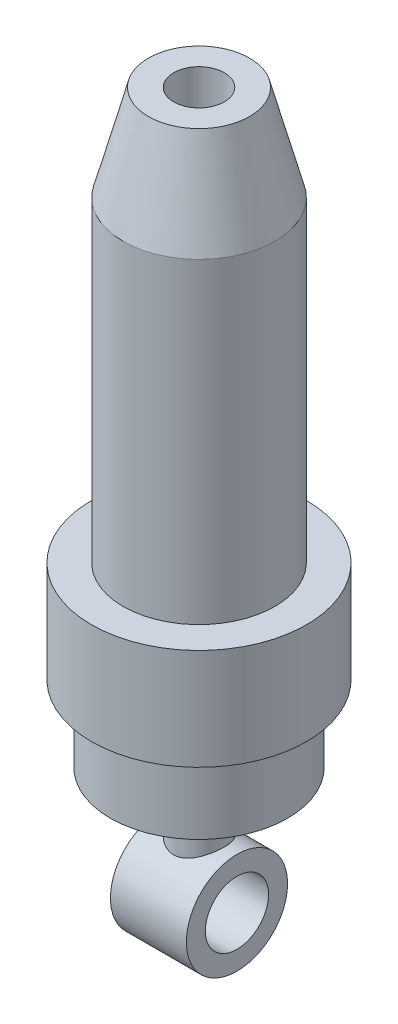
ISO-10303-21;
HEADER;
FILE_DESCRIPTION(('STEP AP214'),'2;1');
FILE_NAME('part.step','',(''),(''),'','','');
FILE_SCHEMA(('AUTOMOTIVE_DESIGN { 1 0 10303 214 1 1 1 1 }'));
ENDSEC;
DATA;
#1=APPLICATION_CONTEXT('core data for automotive mechanical design processes');
#2=APPLICATION_PROTOCOL_DEFINITION('international standard','automotive_design',2000,#1);
#3=PRODUCT_CONTEXT('',#1,'mechanical');
#4=PRODUCT('Part','Part','',(#3));
#5=PRODUCT_RELATED_PRODUCT_CATEGORY('part','',(#4));
#6=PRODUCT_DEFINITION_FORMATION('','',#4);
#7=PRODUCT_DEFINITION_CONTEXT('part definition',#1,'design');
#8=PRODUCT_DEFINITION('design','',#6,#7);
#9=PRODUCT_DEFINITION_SHAPE('','',#8);
#10=(LENGTH_UNIT() NAMED_UNIT(*) SI_UNIT(.MILLI.,.METRE.));
#11=(NAMED_UNIT(*) PLANE_ANGLE_UNIT() SI_UNIT($,.RADIAN.));
#12=(NAMED_UNIT(*) SI_UNIT($,.STERADIAN.) SOLID_ANGLE_UNIT());
#13=UNCERTAINTY_MEASURE_WITH_UNIT(LENGTH_MEASURE(1.E-05),#10,'distance_accuracy_value','');
#14=(GEOMETRIC_REPRESENTATION_CONTEXT(3) GLOBAL_UNCERTAINTY_ASSIGNED_CONTEXT((#13)) GLOBAL_UNIT_ASSIGNED_CONTEXT((#10,
#11,#12)) REPRESENTATION_CONTEXT('',''));
#15=CARTESIAN_POINT('',(0.,0.,0.));
#16=DIRECTION('',(0.,0.,1.));
#17=DIRECTION('',(1.,0.,0.));
#18=AXIS2_PLACEMENT_3D('',#15,#16,#17);
#19=CARTESIAN_POINT('',(0.,-10.,0.));
#20=DIRECTION('',(0.,-1.,0.));
#21=DIRECTION('',(0.,0.,-1.));
#22=AXIS2_PLACEMENT_3D('',#19,#20,#21);
#23=PLANE('',#22);
#24=CARTESIAN_POINT('',(0.,-10.,0.));
#25=DIRECTION('',(0.,1.,0.));
#26=DIRECTION('',(0.,0.,1.));
#27=AXIS2_PLACEMENT_3D('',#24,#25,#26);
#28=CIRCLE('',#27,2.);
#29=CARTESIAN_POINT('',(0.,-10.,2.));
#30=VERTEX_POINT('',#29);
#31=EDGE_CURVE('E114',#30,#30,#28,.T.);
#32=ORIENTED_EDGE('',*,*,#31,.F.);
#33=EDGE_LOOP('',(#32));
#34=FACE_BOUND('',#33,.T.);
#35=CARTESIAN_POINT('',(0.,-10.,0.));
#36=DIRECTION('',(0.,1.,0.));
#37=DIRECTION('',(0.,0.,1.));
#38=AXIS2_PLACEMENT_3D('',#35,#36,#37);
#39=CIRCLE('',#38,4.);
#40=CARTESIAN_POINT('',(0.,-10.,4.));
#41=VERTEX_POINT('',#40);
#42=EDGE_CURVE('E10',#41,#41,#39,.T.);
#43=ORIENTED_EDGE('',*,*,#42,.T.);
#44=EDGE_LOOP('',(#43));
#45=FACE_BOUND('',#44,.T.);
#46=ADVANCED_FACE('F34',(#34,#45),#23,.F.);
#47=CARTESIAN_POINT('',(0.,-17.5358983848622,0.));
#48=DIRECTION('',(0.,-1.,0.));
#49=DIRECTION('',(0.,0.,-1.));
#50=AXIS2_PLACEMENT_3D('',#47,#48,#49);
#51=CONICAL_SURFACE('',#50,6.,0.259416046073647);
#52=ORIENTED_EDGE('',*,*,#42,.F.);
#53=EDGE_LOOP('',(#52));
#54=FACE_BOUND('',#53,.T.);
#55=CARTESIAN_POINT('',(0.,-17.5358983848622,0.));
#56=DIRECTION('',(0.,1.,0.));
#57=DIRECTION('',(0.,0.,1.));
#58=AXIS2_PLACEMENT_3D('',#55,#56,#57);
#59=CIRCLE('',#58,6.);
#60=CARTESIAN_POINT('',(0.,-17.5358983848622,6.));
#61=VERTEX_POINT('',#60);
#62=EDGE_CURVE('E40',#61,#61,#59,.T.);
#63=ORIENTED_EDGE('',*,*,#62,.T.);
#64=EDGE_LOOP('',(#63));
#65=FACE_BOUND('',#64,.T.);
#66=ADVANCED_FACE('F105',(#54,#65),#51,.T.);
#67=CARTESIAN_POINT('',(0.,-10.,0.));
#68=DIRECTION('',(0.,1.,0.));
#69=DIRECTION('',(0.,0.,1.));
#70=AXIS2_PLACEMENT_3D('',#67,#68,#69);
#71=CYLINDRICAL_SURFACE('',#70,6.);
#72=ORIENTED_EDGE('',*,*,#62,.F.);
#73=EDGE_LOOP('',(#72));
#74=FACE_BOUND('',#73,.T.);
#75=CARTESIAN_POINT('',(0.,-42.5358983848622,0.));
#76=DIRECTION('',(0.,1.,0.));
#77=DIRECTION('',(0.,0.,1.));
#78=AXIS2_PLACEMENT_3D('',#75,#76,#77);
#79=CIRCLE('',#78,6.);
#80=CARTESIAN_POINT('',(0.,-42.5358983848622,5.99999999999999));
#81=VERTEX_POINT('',#80);
#82=EDGE_CURVE('E44',#81,#81,#79,.T.);
#83=ORIENTED_EDGE('',*,*,#82,.T.);
#84=EDGE_LOOP('',(#83));
#85=FACE_BOUND('',#84,.T.);
#86=ADVANCED_FACE('F110',(#74,#85),#71,.T.);
#87=CARTESIAN_POINT('',(0.,-42.5358983848622,-6.));
#88=DIRECTION('',(0.,-1.,0.));
#89=DIRECTION('',(0.,0.,-1.));
#90=AXIS2_PLACEMENT_3D('',#87,#88,#89);
#91=PLANE('',#90);
#92=ORIENTED_EDGE('',*,*,#82,.F.);
#93=EDGE_LOOP('',(#92));
#94=FACE_BOUND('',#93,.T.);
#95=CARTESIAN_POINT('',(0.,-42.5358983848622,0.));
#96=DIRECTION('',(0.,1.,0.));
#97=DIRECTION('',(0.,0.,1.));
#98=AXIS2_PLACEMENT_3D('',#95,#96,#97);
#99=CIRCLE('',#98,8.5);
#100=CARTESIAN_POINT('',(0.,-42.5358983848622,8.49999999999999));
#101=VERTEX_POINT('',#100);
#102=EDGE_CURVE('E48',#101,#101,#99,.T.);
#103=ORIENTED_EDGE('',*,*,#102,.T.);
#104=EDGE_LOOP('',(#103));
#105=FACE_BOUND('',#104,.T.);
#106=ADVANCED_FACE('F159',(#94,#105),#91,.F.);
#107=CARTESIAN_POINT('',(0.,-10.,0.));
#108=DIRECTION('',(0.,1.,0.));
#109=DIRECTION('',(0.,0.,1.));
#110=AXIS2_PLACEMENT_3D('',#107,#108,#109);
#111=CYLINDRICAL_SURFACE('',#110,8.5);
#112=ORIENTED_EDGE('',*,*,#102,.F.);
#113=EDGE_LOOP('',(#112));
#114=FACE_BOUND('',#113,.T.);
#115=CARTESIAN_POINT('',(0.,-50.5358983848622,0.));
#116=DIRECTION('',(0.,1.,0.));
#117=DIRECTION('',(0.,0.,1.));
#118=AXIS2_PLACEMENT_3D('',#115,#116,#117);
#119=CIRCLE('',#118,8.5);
#120=CARTESIAN_POINT('',(0.,-50.5358983848622,8.49999999999999));
#121=VERTEX_POINT('',#120);
#122=EDGE_CURVE('E53',#121,#121,#119,.T.);
#123=ORIENTED_EDGE('',*,*,#122,.T.);
#124=EDGE_LOOP('',(#123));
#125=FACE_BOUND('',#124,.T.);
#126=ADVANCED_FACE('F155',(#114,#125),#111,.T.);
#127=CARTESIAN_POINT('',(0.,-50.5358983848622,-8.50000000000001));
#128=DIRECTION('',(0.,1.,0.));
#129=DIRECTION('',(0.,0.,1.));
#130=AXIS2_PLACEMENT_3D('',#127,#128,#129);
#131=PLANE('',#130);
#132=ORIENTED_EDGE('',*,*,#122,.F.);
#133=EDGE_LOOP('',(#132));
#134=FACE_BOUND('',#133,.T.);
#135=CARTESIAN_POINT('',(0.,-50.5358983848622,0.));
#136=DIRECTION('',(0.,1.,0.));
#137=DIRECTION('',(0.,0.,1.));
#138=AXIS2_PLACEMENT_3D('',#135,#136,#137);
#139=CIRCLE('',#138,7.);
#140=CARTESIAN_POINT('',(0.,-50.5358983848622,6.99999999999999));
#141=VERTEX_POINT('',#140);
#142=EDGE_CURVE('E56',#141,#141,#139,.T.);
#143=ORIENTED_EDGE('',*,*,#142,.T.);
#144=EDGE_LOOP('',(#143));
#145=FACE_BOUND('',#144,.T.);
#146=ADVANCED_FACE('F148',(#134,#145),#131,.F.);
#147=CARTESIAN_POINT('',(0.,-10.,0.));
#148=DIRECTION('',(0.,1.,0.));
#149=DIRECTION('',(0.,0.,1.));
#150=AXIS2_PLACEMENT_3D('',#147,#148,#149);
#151=CYLINDRICAL_SURFACE('',#150,7.);
#152=ORIENTED_EDGE('',*,*,#142,.F.);
#153=EDGE_LOOP('',(#152));
#154=FACE_BOUND('',#153,.T.);
#155=CARTESIAN_POINT('',(0.,-56.5358983848622,0.));
#156=DIRECTION('',(0.,1.,0.));
#157=DIRECTION('',(0.,0.,1.));
#158=AXIS2_PLACEMENT_3D('',#155,#156,#157);
#159=CIRCLE('',#158,7.);
#160=CARTESIAN_POINT('',(0.,-56.5358983848622,6.99999999999999));
#161=VERTEX_POINT('',#160);
#162=EDGE_CURVE('E59',#161,#161,#159,.T.);
#163=ORIENTED_EDGE('',*,*,#162,.T.);
#164=EDGE_LOOP('',(#163));
#165=FACE_BOUND('',#164,.T.);
#166=ADVANCED_FACE('F141',(#154,#165),#151,.T.);
#167=CARTESIAN_POINT('',(0.,-56.5358983848622,-7.00000000000001));
#168=DIRECTION('',(0.,1.,0.));
#169=DIRECTION('',(0.,0.,1.));
#170=AXIS2_PLACEMENT_3D('',#167,#168,#169);
#171=PLANE('',#170);
#172=ORIENTED_EDGE('',*,*,#162,.F.);
#173=EDGE_LOOP('',(#172));
#174=FACE_BOUND('',#173,.T.);
#175=CARTESIAN_POINT('',(0.,-56.5358983848623,0.));
#176=DIRECTION('',(0.,1.,0.));
#177=DIRECTION('',(0.,0.,1.));
#178=AXIS2_PLACEMENT_3D('',#175,#176,#177);
#179=CIRCLE('',#178,2.);
#180=CARTESIAN_POINT('',(0.,-56.5358983848623,1.99999999999999));
#181=VERTEX_POINT('',#180);
#182=EDGE_CURVE('E62',#181,#181,#179,.T.);
#183=ORIENTED_EDGE('',*,*,#182,.T.);
#184=EDGE_LOOP('',(#183));
#185=FACE_BOUND('',#184,.T.);
#186=ADVANCED_FACE('F136',(#174,#185),#171,.F.);
#187=CARTESIAN_POINT('',(0.,-10.,0.));
#188=DIRECTION('',(0.,1.,0.));
#189=DIRECTION('',(0.,0.,1.));
#190=AXIS2_PLACEMENT_3D('',#187,#188,#189);
#191=CYLINDRICAL_SURFACE('',#190,2.);
#192=ORIENTED_EDGE('',*,*,#182,.F.);
#193=EDGE_LOOP('',(#192));
#194=FACE_BOUND('',#193,.T.);
#195=CARTESIAN_POINT('',(0.,-61.5358983848622,1.99999999999999));
#196=CARTESIAN_POINT('',(0.104213205474344,-61.5358881428411,1.99999158748779));
#197=CARTESIAN_POINT('',(0.208562176533798,-61.5311236645502,1.99179963610435));
#198=CARTESIAN_POINT('',(0.414055177230599,-61.5127529833093,1.95944672580051));
#199=CARTESIAN_POINT('',(0.515192003247759,-61.4991282021182,1.9352522109566));
#200=CARTESIAN_POINT('',(0.710903156446932,-61.4650129851,1.87219981598029));
#201=CARTESIAN_POINT('',(0.805509258849248,-61.4445591093083,1.83341988295962));
#202=CARTESIAN_POINT('',(0.986848450476151,-61.3991467270887,1.74253507245137));
#203=CARTESIAN_POINT('',(1.07358111343677,-61.3741879769875,1.69042947410137));
#204=CARTESIAN_POINT('',(1.24461144313338,-61.3200626118071,1.56933307453799));
#205=CARTESIAN_POINT('',(1.32811826759177,-61.290718725349,1.49930407053532));
#206=CARTESIAN_POINT('',(1.4828167805706,-61.2325603461788,1.346507616982));
#207=CARTESIAN_POINT('',(1.55400232620397,-61.2037461238974,1.2637338520484));
#208=CARTESIAN_POINT('',(1.68673430118849,-61.1475704603834,1.08097912631264));
#209=CARTESIAN_POINT('',(1.7473075354233,-61.1204378714875,0.98021437788714));
#210=CARTESIAN_POINT('',(1.85028170678709,-61.0729848781583,0.768314053336905));
#211=CARTESIAN_POINT('',(1.89269411235079,-61.0526601763637,0.657185076311973));
#212=CARTESIAN_POINT('',(1.95500932253117,-61.0223907750795,0.436089887818805));
#213=CARTESIAN_POINT('',(1.9762990526921,-61.0118103955726,0.326603580968774));
#214=CARTESIAN_POINT('',(2.00033223736903,-60.9998483230882,0.10514125740453));
#215=CARTESIAN_POINT('',(2.00308691359628,-60.9984610643107,-0.00683321168521773));
#216=CARTESIAN_POINT('',(1.99050665205486,-61.0047403616688,-0.219665048849582));
#217=CARTESIAN_POINT('',(1.97672396895636,-61.0116300821562,-0.320642398354148));
#218=CARTESIAN_POINT('',(1.93423831219187,-61.0325150948057,-0.518627543836098));
#219=CARTESIAN_POINT('',(1.90553422204787,-61.0465109186723,-0.61563504218771));
#220=CARTESIAN_POINT('',(1.83383486782004,-61.0805683342467,-0.804618783139268));
#221=CARTESIAN_POINT('',(1.79064737365577,-61.100711169416,-0.896506847030406));
#222=CARTESIAN_POINT('',(1.6914731675971,-61.1452470802663,-1.07195360302662));
#223=CARTESIAN_POINT('',(1.63548187339532,-61.1696416768503,-1.15550929767729));
#224=CARTESIAN_POINT('',(1.50620929693394,-61.2231121120154,-1.32034732179641));
#225=CARTESIAN_POINT('',(1.43179394334797,-61.2524124800365,-1.40066815005873));
#226=CARTESIAN_POINT('',(1.27082055013965,-61.3109131882638,-1.54820874059557));
#227=CARTESIAN_POINT('',(1.18425325545187,-61.3401134346874,-1.61541842314847));
#228=CARTESIAN_POINT('',(0.994703615151819,-61.3971168781503,-1.73901066928443));
#229=CARTESIAN_POINT('',(0.891027953891573,-61.4247136001858,-1.79443462995611));
#230=CARTESIAN_POINT('',(0.674124657282,-61.4724909944285,-1.88663822600247));
#231=CARTESIAN_POINT('',(0.560907133964871,-61.4926793990787,-1.92343731642179));
#232=CARTESIAN_POINT('',(0.337570977434418,-61.5211072836593,-1.97436042205009));
#233=CARTESIAN_POINT('',(0.2279177619129,-61.5301668830301,-1.99005024423996));
#234=CARTESIAN_POINT('',(0.00719731696690866,-61.5376416127678,-2.00303389322286));
#235=CARTESIAN_POINT('',(-0.103868858239598,-61.5360642622138,-2.00034071463006));
#236=CARTESIAN_POINT('',(-0.311307837157438,-61.5233132691883,-1.97807208668794));
#237=CARTESIAN_POINT('',(-0.407958902215785,-61.5132082498669,-1.96037563342493));
#238=CARTESIAN_POINT('',(-0.596735572541989,-61.4861195689732,-1.9113925692649));
#239=CARTESIAN_POINT('',(-0.688859701493481,-61.4691336798993,-1.88010155724727));
#240=CARTESIAN_POINT('',(-0.870822661805114,-61.4292755584069,-1.80329517720974));
#241=CARTESIAN_POINT('',(-0.960358033706049,-61.4061671351387,-1.7571881273853));
#242=CARTESIAN_POINT('',(-1.13093854307904,-61.356877610055,-1.65257412803176));
#243=CARTESIAN_POINT('',(-1.21197928703051,-61.330694932897,-1.59406080866499));
#244=CARTESIAN_POINT('',(-1.37395753504265,-61.2742400308733,-1.45767433439709));
#245=CARTESIAN_POINT('',(-1.45359430141777,-61.2438683369143,-1.37829054462748));
#246=CARTESIAN_POINT('',(-1.59882447600473,-61.185315300442,-1.20680899079904));
#247=CARTESIAN_POINT('',(-1.66441314052683,-61.1571346998454,-1.11470694931991));
#248=CARTESIAN_POINT('',(-1.78114745183271,-61.1051727661813,-0.917070725108065));
#249=CARTESIAN_POINT('',(-1.83186623616677,-61.0815271665612,-0.811246195112499));
#250=CARTESIAN_POINT('',(-1.91427580796961,-61.0423329008122,-0.59104472931787));
#251=CARTESIAN_POINT('',(-1.94598330368409,-61.026777126466,-0.476675402917658));
#252=CARTESIAN_POINT('',(-1.98673712748513,-61.0066498363683,-0.253959364539771));
#253=CARTESIAN_POINT('',(-1.99759574866427,-61.0012014418573,-0.146022887268308));
#254=CARTESIAN_POINT('',(-2.00168653399567,-60.9991573924763,0.070251971469937));
#255=CARTESIAN_POINT('',(-1.99492486852886,-61.0025586385837,0.178590198981605));
#256=CARTESIAN_POINT('',(-1.96516717568359,-61.0173206233149,0.38507598613685));
#257=CARTESIAN_POINT('',(-1.94327026269094,-61.0281421069056,0.48342464105741));
#258=CARTESIAN_POINT('',(-1.88534604019333,-61.0561581264661,0.674891898931556));
#259=CARTESIAN_POINT('',(-1.84931670429308,-61.0733535763558,0.768009749669762));
#260=CARTESIAN_POINT('',(-1.76254574500859,-61.1134813860682,0.95084683359673));
#261=CARTESIAN_POINT('',(-1.71124078024814,-61.136627659946,1.04025036572289));
#262=CARTESIAN_POINT('',(-1.5960847118819,-61.1862373332397,1.20954920326827));
#263=CARTESIAN_POINT('',(-1.53222784589843,-61.2127022541657,1.28944011444317));
#264=CARTESIAN_POINT('',(-1.38640336444058,-61.2694278115942,1.44582833859494));
#265=CARTESIAN_POINT('',(-1.30326581919971,-61.2998040827392,1.52119665879198));
#266=CARTESIAN_POINT('',(-1.12510777169391,-61.3587384137143,1.65732528394005));
#267=CARTESIAN_POINT('',(-1.03007686863948,-61.3872948486922,1.71807266521242));
#268=CARTESIAN_POINT('',(-0.826691105869752,-61.4400081374325,1.82486714716809));
#269=CARTESIAN_POINT('',(-0.718010089264723,-61.4639974373146,1.87038902381912));
#270=CARTESIAN_POINT('',(-0.549421880369052,-61.4930378186763,1.92395929504799));
#271=CARTESIAN_POINT('',(-0.492352179409319,-61.501556106706,1.93935666147966));
#272=CARTESIAN_POINT('',(-0.376767442499808,-61.5159394067647,1.96508069805041));
#273=CARTESIAN_POINT('',(-0.318253447245746,-61.5218062736395,1.97541091343281));
#274=CARTESIAN_POINT('',(-0.216399210752708,-61.5294097633124,1.98872932961219));
#275=CARTESIAN_POINT('',(-0.173266942749925,-61.5318361026818,1.99295091983785));
#276=CARTESIAN_POINT('',(-0.0867643069071036,-61.5350825995482,1.99858810035604));
#277=CARTESIAN_POINT('',(-0.0433939233332999,-61.5359026495951,2.0000035029333));
#278=CARTESIAN_POINT('',(0.,-61.5358983848622,1.99999999999999));
#279=B_SPLINE_CURVE_WITH_KNOTS('',3,(#195,#196,#197,#198,#199,#200,#201,#202,#203,#204,#205,
#206,#207,#208,#209,#210,#211,#212,#213,#214,#215,#216,#217,#218,#219,#220,#221,#222,#223,#224,
#225,#226,#227,#228,#229,#230,#231,#232,#233,#234,#235,#236,#237,#238,#239,#240,#241,#242,#243,
#244,#245,#246,#247,#248,#249,#250,#251,#252,#253,#254,#255,#256,#257,#258,#259,#260,#261,#262,
#263,#264,#265,#266,#267,#268,#269,#270,#271,#272,#273,#274,#275,#276,#277,#278),.UNSPECIFIED.,
.T.,.F.,(4,2,2,2,2,2,2,2,2,2,2,2,2,2,2,2,2,2,2,2,2,2,2,2,2,2,2,2,2,2,2,2,2,2,2,2,2,2,2,2,2,4),
(0.,0.31246424518943,0.625585785649608,0.937057191861533,1.24854545093096,1.58572462503713,
1.92307142172808,2.28315784481593,2.64301653931848,2.97726969939936,3.31132047376146,
3.61632194973143,3.92134625038976,4.23059069466359,4.53994598704609,4.87854382917847,
5.21740096495903,5.57777683462963,5.93777548427475,6.26924581712489,6.60048186380812,
6.89548366852116,7.19058104876192,7.49934592816241,7.8082697244416,8.15613487165291,
8.5041172996047,8.86128362829997,9.21813559621608,9.54224540783039,9.86624173592008,
10.1688884974705,10.4715786702809,10.7872150144301,11.102996602055,11.450204837042,
11.7977188569437,12.1562149808127,12.3351395323571,12.5139387197526,12.6440387634035,
12.7741475095882),.UNSPECIFIED.);
#280=CARTESIAN_POINT('',(0.,-61.5358983848622,1.99999999999999));
#281=VERTEX_POINT('',#280);
#282=EDGE_CURVE('E65',#281,#281,#279,.T.);
#283=ORIENTED_EDGE('',*,*,#282,.T.);
#284=EDGE_LOOP('',(#283));
#285=FACE_BOUND('',#284,.T.);
#286=ADVANCED_FACE('F74',(#194,#285),#191,.T.);
#287=CARTESIAN_POINT('',(-3.,-65.,0.));
#288=DIRECTION('',(1.,0.,0.));
#289=DIRECTION('',(0.,0.,-1.));
#290=AXIS2_PLACEMENT_3D('',#287,#288,#289);
#291=CYLINDRICAL_SURFACE('',#290,4.);
#292=CARTESIAN_POINT('',(3.,-65.,0.));
#293=DIRECTION('',(1.,0.,0.));
#294=DIRECTION('',(0.,0.,-1.));
#295=AXIS2_PLACEMENT_3D('',#292,#293,#294);
#296=CIRCLE('',#295,4.);
#297=CARTESIAN_POINT('',(3.,-65.,-4.00000000000001));
#298=VERTEX_POINT('',#297);
#299=EDGE_CURVE('E123',#298,#298,#296,.T.);
#300=ORIENTED_EDGE('',*,*,#299,.F.);
#301=EDGE_LOOP('',(#300));
#302=FACE_BOUND('',#301,.T.);
#303=CARTESIAN_POINT('',(-3.,-65.,0.));
#304=DIRECTION('',(1.,0.,0.));
#305=DIRECTION('',(0.,0.,-1.));
#306=AXIS2_PLACEMENT_3D('',#303,#304,#305);
#307=CIRCLE('',#306,4.);
#308=CARTESIAN_POINT('',(-3.,-65.,-4.00000000000001));
#309=VERTEX_POINT('',#308);
#310=EDGE_CURVE('E72',#309,#309,#307,.T.);
#311=ORIENTED_EDGE('',*,*,#310,.T.);
#312=EDGE_LOOP('',(#311));
#313=FACE_BOUND('',#312,.T.);
#314=ORIENTED_EDGE('',*,*,#282,.F.);
#315=EDGE_LOOP('',(#314));
#316=FACE_BOUND('',#315,.T.);
#317=ADVANCED_FACE('F77',(#302,#313,#316),#291,.T.);
#318=CARTESIAN_POINT('',(-3.,-65.,0.));
#319=DIRECTION('',(1.,0.,0.));
#320=DIRECTION('',(0.,0.,-1.));
#321=AXIS2_PLACEMENT_3D('',#318,#319,#320);
#322=PLANE('',#321);
#323=CARTESIAN_POINT('',(-3.,-65.,0.));
#324=DIRECTION('',(1.,0.,0.));
#325=DIRECTION('',(0.,0.,-1.));
#326=AXIS2_PLACEMENT_3D('',#323,#324,#325);
#327=CIRCLE('',#326,2.5);
#328=CARTESIAN_POINT('',(-3.,-65.,-2.50000000000001));
#329=VERTEX_POINT('',#328);
#330=EDGE_CURVE('E125',#329,#329,#327,.T.);
#331=ORIENTED_EDGE('',*,*,#330,.T.);
#332=EDGE_LOOP('',(#331));
#333=FACE_BOUND('',#332,.T.);
#334=ORIENTED_EDGE('',*,*,#310,.F.);
#335=EDGE_LOOP('',(#334));
#336=FACE_BOUND('',#335,.T.);
#337=ADVANCED_FACE('F81',(#333,#336),#322,.F.);
#338=CARTESIAN_POINT('',(-3.,-65.,0.));
#339=DIRECTION('',(1.,0.,0.));
#340=DIRECTION('',(0.,0.,-1.));
#341=AXIS2_PLACEMENT_3D('',#338,#339,#340);
#342=CYLINDRICAL_SURFACE('',#341,2.5);
#343=ORIENTED_EDGE('',*,*,#330,.F.);
#344=EDGE_LOOP('',(#343));
#345=FACE_BOUND('',#344,.T.);
#346=CARTESIAN_POINT('',(3.,-65.,0.));
#347=DIRECTION('',(1.,0.,0.));
#348=DIRECTION('',(0.,0.,-1.));
#349=AXIS2_PLACEMENT_3D('',#346,#347,#348);
#350=CIRCLE('',#349,2.5);
#351=CARTESIAN_POINT('',(3.,-65.,-2.50000000000001));
#352=VERTEX_POINT('',#351);
#353=EDGE_CURVE('E118',#352,#352,#350,.T.);
#354=ORIENTED_EDGE('',*,*,#353,.T.);
#355=EDGE_LOOP('',(#354));
#356=FACE_BOUND('',#355,.T.);
#357=ADVANCED_FACE('F85',(#345,#356),#342,.F.);
#358=CARTESIAN_POINT('',(3.,-65.,0.));
#359=DIRECTION('',(1.,0.,0.));
#360=DIRECTION('',(0.,0.,-1.));
#361=AXIS2_PLACEMENT_3D('',#358,#359,#360);
#362=PLANE('',#361);
#363=ORIENTED_EDGE('',*,*,#299,.T.);
#364=EDGE_LOOP('',(#363));
#365=FACE_BOUND('',#364,.T.);
#366=ORIENTED_EDGE('',*,*,#353,.F.);
#367=EDGE_LOOP('',(#366));
#368=FACE_BOUND('',#367,.T.);
#369=ADVANCED_FACE('F89',(#365,#368),#362,.T.);
#370=CARTESIAN_POINT('',(0.,-40.,0.));
#371=DIRECTION('',(0.,1.,0.));
#372=DIRECTION('',(0.,0.,1.));
#373=AXIS2_PLACEMENT_3D('',#370,#371,#372);
#374=CYLINDRICAL_SURFACE('',#373,2.);
#375=CARTESIAN_POINT('',(0.,-40.,0.));
#376=DIRECTION('',(0.,1.,0.));
#377=DIRECTION('',(0.,0.,1.));
#378=AXIS2_PLACEMENT_3D('',#375,#376,#377);
#379=CIRCLE('',#378,2.);
#380=CARTESIAN_POINT('',(0.,-40.,1.99999999999999));
#381=VERTEX_POINT('',#380);
#382=EDGE_CURVE('E116',#381,#381,#379,.T.);
#383=ORIENTED_EDGE('',*,*,#382,.F.);
#384=EDGE_LOOP('',(#383));
#385=FACE_BOUND('',#384,.T.);
#386=ORIENTED_EDGE('',*,*,#31,.T.);
#387=EDGE_LOOP('',(#386));
#388=FACE_BOUND('',#387,.T.);
#389=ADVANCED_FACE('F93',(#385,#388),#374,.F.);
#390=CARTESIAN_POINT('',(0.,-40.,0.));
#391=DIRECTION('',(0.,1.,0.));
#392=DIRECTION('',(0.,0.,1.));
#393=AXIS2_PLACEMENT_3D('',#390,#391,#392);
#394=PLANE('',#393);
#395=ORIENTED_EDGE('',*,*,#382,.T.);
#396=EDGE_LOOP('',(#395));
#397=FACE_BOUND('',#396,.T.);
#398=ADVANCED_FACE('F97',(#397),#394,.T.);
#399=CLOSED_SHELL('',(#46,#66,#86,#106,#126,#146,#166,#186,#286,#317,#337,#357,#369,#389,#398));
#400=MANIFOLD_SOLID_BREP('B2',#399);
#401=ADVANCED_BREP_SHAPE_REPRESENTATION('',(#18,#400),#14);
#402=SHAPE_DEFINITION_REPRESENTATION(#9,#401);
ENDSEC;
END-ISO-10303-21;
